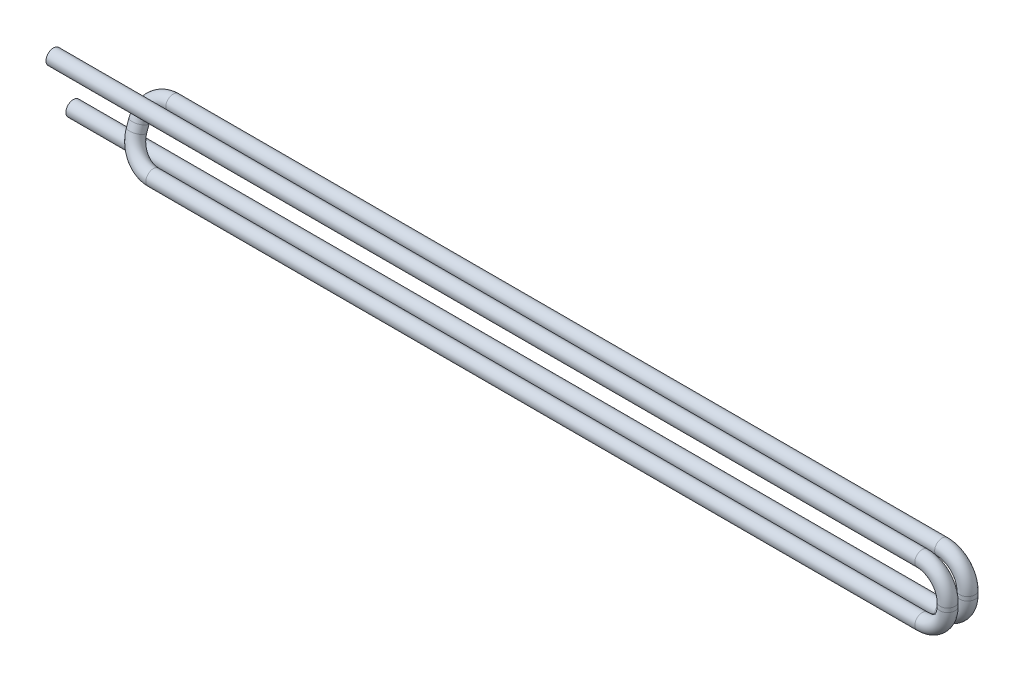
ISO-10303-21;
HEADER;
FILE_DESCRIPTION(('STEP AP214'),'2;1');
FILE_NAME('part.step','',(''),(''),'','','');
FILE_SCHEMA(('AUTOMOTIVE_DESIGN { 1 0 10303 214 1 1 1 1 }'));
ENDSEC;
DATA;
#1=APPLICATION_CONTEXT('core data for automotive mechanical design processes');
#2=APPLICATION_PROTOCOL_DEFINITION('international standard','automotive_design',2000,#1);
#3=PRODUCT_CONTEXT('',#1,'mechanical');
#4=PRODUCT('Part','Part','',(#3));
#5=PRODUCT_RELATED_PRODUCT_CATEGORY('part','',(#4));
#6=PRODUCT_DEFINITION_FORMATION('','',#4);
#7=PRODUCT_DEFINITION_CONTEXT('part definition',#1,'design');
#8=PRODUCT_DEFINITION('design','',#6,#7);
#9=PRODUCT_DEFINITION_SHAPE('','',#8);
#10=(LENGTH_UNIT() NAMED_UNIT(*) SI_UNIT(.MILLI.,.METRE.));
#11=(NAMED_UNIT(*) PLANE_ANGLE_UNIT() SI_UNIT($,.RADIAN.));
#12=(NAMED_UNIT(*) SI_UNIT($,.STERADIAN.) SOLID_ANGLE_UNIT());
#13=UNCERTAINTY_MEASURE_WITH_UNIT(LENGTH_MEASURE(1.E-05),#10,'distance_accuracy_value','');
#14=(GEOMETRIC_REPRESENTATION_CONTEXT(3) GLOBAL_UNCERTAINTY_ASSIGNED_CONTEXT((#13)) GLOBAL_UNIT_ASSIGNED_CONTEXT((#10,
#11,#12)) REPRESENTATION_CONTEXT('',''));
#15=CARTESIAN_POINT('',(0.,0.,0.));
#16=DIRECTION('',(0.,0.,1.));
#17=DIRECTION('',(1.,0.,0.));
#18=AXIS2_PLACEMENT_3D('',#15,#16,#17);
#19=CARTESIAN_POINT('',(-1.02125570784735,2.20000000001825,0.799999999708592));
#20=DIRECTION('',(-1.,0.,0.));
#21=DIRECTION('',(0.,0.,1.));
#22=AXIS2_PLACEMENT_3D('',#19,#20,#21);
#23=CYLINDRICAL_SURFACE('',#22,0.3);
#24=CARTESIAN_POINT('',(-1.02125570784735,2.20000000001825,0.799999999708592));
#25=DIRECTION('',(-1.,0.,0.));
#26=DIRECTION('',(0.,0.642335766239947,-0.766423357817949));
#27=AXIS2_PLACEMENT_3D('',#24,#25,#26);
#28=CIRCLE('',#27,0.3);
#29=CARTESIAN_POINT('',(-1.02125570784735,2.50000000001825,0.799999999708592));
#30=VERTEX_POINT('',#29);
#31=EDGE_CURVE('E38',#30,#30,#28,.T.);
#32=ORIENTED_EDGE('',*,*,#31,.T.);
#33=EDGE_LOOP('',(#32));
#34=FACE_BOUND('',#33,.T.);
#35=CARTESIAN_POINT('',(-36.,2.20000000001825,0.799999999708591));
#36=DIRECTION('',(-1.,0.,0.));
#37=DIRECTION('',(0.,0.642335766239947,-0.766423357817949));
#38=AXIS2_PLACEMENT_3D('',#35,#36,#37);
#39=CIRCLE('',#38,0.3);
#40=CARTESIAN_POINT('',(-36.,2.39270072989023,0.570072992363207));
#41=VERTEX_POINT('',#40);
#42=EDGE_CURVE('E10',#41,#41,#39,.T.);
#43=ORIENTED_EDGE('',*,*,#42,.F.);
#44=EDGE_LOOP('',(#43));
#45=FACE_BOUND('',#44,.T.);
#46=ADVANCED_FACE('F32',(#34,#45),#23,.T.);
#47=CARTESIAN_POINT('',(-1.02125570784735,1.17874429215265,0.799999999708592));
#48=DIRECTION('',(0.,0.,1.));
#49=DIRECTION('',(1.,0.,0.));
#50=AXIS2_PLACEMENT_3D('',#47,#48,#49);
#51=TOROIDAL_SURFACE('',#50,1.0212557078656,0.3);
#52=CARTESIAN_POINT('',(1.82485338164642E-11,1.17874429215265,0.799999999708592));
#53=DIRECTION('',(0.,1.,0.));
#54=DIRECTION('',(0.642335766239947,0.,-0.766423357817949));
#55=AXIS2_PLACEMENT_3D('',#52,#53,#54);
#56=CIRCLE('',#55,0.3);
#57=CARTESIAN_POINT('',(0.300000000018249,1.17874429215265,0.799999999708592));
#58=VERTEX_POINT('',#57);
#59=EDGE_CURVE('E42',#58,#58,#56,.T.);
#60=CARTESIAN_POINT('',(-1.02125570784735,1.17874429215265,0.799999999708592));
#61=DIRECTION('',(0.,0.,1.));
#62=DIRECTION('',(1.,0.,0.));
#63=AXIS2_PLACEMENT_3D('',#60,#61,#62);
#64=CIRCLE('',#63,1.3212557078656);
#65=EDGE_CURVE('',#58,#30,#64,.T.);
#66=ORIENTED_EDGE('',*,*,#59,.T.);
#67=ORIENTED_EDGE('',*,*,#31,.F.);
#68=ORIENTED_EDGE('',*,*,#65,.T.);
#69=ORIENTED_EDGE('',*,*,#65,.F.);
#70=EDGE_LOOP('',(#66,#68,#67,#69));
#71=FACE_BOUND('',#70,.T.);
#72=ADVANCED_FACE('F100',(#71),#51,.T.);
#73=CARTESIAN_POINT('',(1.82486207307168E-11,1.02125570784735,0.799999999708592));
#74=DIRECTION('',(0.,1.,0.));
#75=DIRECTION('',(-1.,0.,0.));
#76=AXIS2_PLACEMENT_3D('',#73,#74,#75);
#77=CYLINDRICAL_SURFACE('',#76,0.3);
#78=CARTESIAN_POINT('',(1.82486207307168E-11,1.02125570784735,0.799999999708592));
#79=DIRECTION('',(0.,1.,0.));
#80=DIRECTION('',(0.642335766239947,0.,-0.766423357817949));
#81=AXIS2_PLACEMENT_3D('',#78,#79,#80);
#82=CIRCLE('',#81,0.3);
#83=CARTESIAN_POINT('',(0.300000000018249,1.02125570784735,0.799999999708592));
#84=VERTEX_POINT('',#83);
#85=EDGE_CURVE('E46',#84,#84,#82,.T.);
#86=ORIENTED_EDGE('',*,*,#85,.T.);
#87=EDGE_LOOP('',(#86));
#88=FACE_BOUND('',#87,.T.);
#89=ORIENTED_EDGE('',*,*,#59,.F.);
#90=EDGE_LOOP('',(#89));
#91=FACE_BOUND('',#90,.T.);
#92=ADVANCED_FACE('F104',(#88,#91),#77,.T.);
#93=CARTESIAN_POINT('',(-1.02125570784735,1.02125570784735,0.799999999708592));
#94=DIRECTION('',(0.,0.,1.));
#95=DIRECTION('',(1.,0.,0.));
#96=AXIS2_PLACEMENT_3D('',#93,#94,#95);
#97=TOROIDAL_SURFACE('',#96,1.0212557078656,0.3);
#98=CARTESIAN_POINT('',(-1.02125570784736,-1.82480908015536E-11,0.799999999708592));
#99=DIRECTION('',(1.,0.,0.));
#100=DIRECTION('',(0.,-0.642335766239947,-0.766423357817949));
#101=AXIS2_PLACEMENT_3D('',#98,#99,#100);
#102=CIRCLE('',#101,0.3);
#103=CARTESIAN_POINT('',(-1.02125570784736,-0.300000000018248,0.799999999708592));
#104=VERTEX_POINT('',#103);
#105=EDGE_CURVE('E51',#104,#104,#102,.T.);
#106=CARTESIAN_POINT('',(-1.02125570784735,1.02125570784735,0.799999999708592));
#107=DIRECTION('',(0.,0.,1.));
#108=DIRECTION('',(1.,0.,0.));
#109=AXIS2_PLACEMENT_3D('',#106,#107,#108);
#110=CIRCLE('',#109,1.3212557078656);
#111=EDGE_CURVE('',#104,#84,#110,.T.);
#112=ORIENTED_EDGE('',*,*,#105,.T.);
#113=ORIENTED_EDGE('',*,*,#85,.F.);
#114=ORIENTED_EDGE('',*,*,#111,.T.);
#115=ORIENTED_EDGE('',*,*,#111,.F.);
#116=EDGE_LOOP('',(#112,#114,#113,#115));
#117=FACE_BOUND('',#116,.T.);
#118=ADVANCED_FACE('F110',(#117),#97,.T.);
#119=CARTESIAN_POINT('',(-31.9787442921527,-1.8249290967276E-11,0.799999999708593));
#120=DIRECTION('',(1.,0.,0.));
#121=DIRECTION('',(0.,1.,0.));
#122=AXIS2_PLACEMENT_3D('',#119,#120,#121);
#123=CYLINDRICAL_SURFACE('',#122,0.3);
#124=CARTESIAN_POINT('',(-31.9787442921527,-1.8249290967276E-11,0.799999999708593));
#125=DIRECTION('',(1.,0.,0.));
#126=DIRECTION('',(0.,-0.642335766239947,-0.766423357817949));
#127=AXIS2_PLACEMENT_3D('',#124,#125,#126);
#128=CIRCLE('',#127,0.3);
#129=CARTESIAN_POINT('',(-31.9787442921527,-0.281938027077051,0.902522918600871));
#130=VERTEX_POINT('',#129);
#131=EDGE_CURVE('E54',#130,#130,#128,.T.);
#132=ORIENTED_EDGE('',*,*,#131,.T.);
#133=EDGE_LOOP('',(#132));
#134=FACE_BOUND('',#133,.T.);
#135=ORIENTED_EDGE('',*,*,#105,.F.);
#136=EDGE_LOOP('',(#135));
#137=FACE_BOUND('',#136,.T.);
#138=ADVANCED_FACE('F117',(#134,#137),#123,.T.);
#139=CARTESIAN_POINT('',(-31.9787442921526,0.959769397967603,0.450992946025579));
#140=DIRECTION('',(0.,0.341743062974255,0.939793423529328));
#141=DIRECTION('',(0.,-0.939793423529328,0.341743062974255));
#142=AXIS2_PLACEMENT_3D('',#139,#140,#141);
#143=TOROIDAL_SURFACE('',#142,1.02125570785706,0.3);
#144=CARTESIAN_POINT('',(-33.0000000000097,0.959769397967603,0.450992946025579));
#145=DIRECTION('',(0.,-0.939793423529327,0.341743062974256));
#146=DIRECTION('',(-0.341743062974255,-0.321167883119971,-0.883211678908975));
#147=AXIS2_PLACEMENT_3D('',#144,#145,#146);
#148=CIRCLE('',#147,0.3);
#149=CARTESIAN_POINT('',(-33.3000000000097,0.959769397967603,0.450992946025579));
#150=VERTEX_POINT('',#149);
#151=EDGE_CURVE('E57',#150,#150,#148,.T.);
#152=CARTESIAN_POINT('',(-31.9787442921526,0.959769397967603,0.450992946025579));
#153=DIRECTION('',(0.,0.341743062974255,0.939793423529328));
#154=DIRECTION('',(0.,-0.939793423529328,0.341743062974255));
#155=AXIS2_PLACEMENT_3D('',#152,#153,#154);
#156=CIRCLE('',#155,1.32125570785706);
#157=EDGE_CURVE('',#150,#130,#156,.T.);
#158=ORIENTED_EDGE('',*,*,#151,.T.);
#159=ORIENTED_EDGE('',*,*,#131,.F.);
#160=ORIENTED_EDGE('',*,*,#157,.T.);
#161=ORIENTED_EDGE('',*,*,#157,.F.);
#162=EDGE_LOOP('',(#158,#160,#159,#161));
#163=FACE_BOUND('',#162,.T.);
#164=ADVANCED_FACE('F121',(#163),#143,.T.);
#165=CARTESIAN_POINT('',(-33.0000000000097,1.24023060201414,0.349007053683015));
#166=DIRECTION('',(0.,-0.939793423529328,0.341743062974255));
#167=DIRECTION('',(0.,-0.341743062974255,-0.939793423529328));
#168=AXIS2_PLACEMENT_3D('',#165,#166,#167);
#169=CYLINDRICAL_SURFACE('',#168,0.3);
#170=CARTESIAN_POINT('',(-33.0000000000097,1.24023060201414,0.349007053683015));
#171=DIRECTION('',(0.,-0.939793423529327,0.341743062974256));
#172=DIRECTION('',(-0.341743062974255,-0.321167883119971,-0.883211678908975));
#173=AXIS2_PLACEMENT_3D('',#170,#171,#172);
#174=CIRCLE('',#173,0.3);
#175=CARTESIAN_POINT('',(-33.3000000000097,1.24023060201414,0.349007053683015));
#176=VERTEX_POINT('',#175);
#177=EDGE_CURVE('E60',#176,#176,#174,.T.);
#178=ORIENTED_EDGE('',*,*,#177,.T.);
#179=EDGE_LOOP('',(#178));
#180=FACE_BOUND('',#179,.T.);
#181=ORIENTED_EDGE('',*,*,#151,.F.);
#182=EDGE_LOOP('',(#181));
#183=FACE_BOUND('',#182,.T.);
#184=ADVANCED_FACE('F125',(#180,#183),#169,.T.);
#185=CARTESIAN_POINT('',(-31.9787442921526,1.24023060201414,0.349007053683014));
#186=DIRECTION('',(0.,0.341743062974255,0.939793423529328));
#187=DIRECTION('',(0.,-0.939793423529328,0.341743062974255));
#188=AXIS2_PLACEMENT_3D('',#185,#186,#187);
#189=TOROIDAL_SURFACE('',#188,1.02125570785707,0.3);
#190=CARTESIAN_POINT('',(-31.9787442921527,2.2,0.));
#191=DIRECTION('',(-1.,0.,0.));
#192=DIRECTION('',(0.,0.,-1.));
#193=AXIS2_PLACEMENT_3D('',#190,#191,#192);
#194=CIRCLE('',#193,0.3);
#195=CARTESIAN_POINT('',(-31.9787442921527,2.4819380270588,-0.102522918892277));
#196=VERTEX_POINT('',#195);
#197=EDGE_CURVE('E63',#196,#196,#194,.T.);
#198=CARTESIAN_POINT('',(-31.9787442921526,1.24023060201414,0.349007053683014));
#199=DIRECTION('',(0.,0.341743062974255,0.939793423529328));
#200=DIRECTION('',(0.,-0.939793423529328,0.341743062974255));
#201=AXIS2_PLACEMENT_3D('',#198,#199,#200);
#202=CIRCLE('',#201,1.32125570785707);
#203=EDGE_CURVE('',#196,#176,#202,.T.);
#204=ORIENTED_EDGE('',*,*,#197,.T.);
#205=ORIENTED_EDGE('',*,*,#177,.F.);
#206=ORIENTED_EDGE('',*,*,#203,.T.);
#207=ORIENTED_EDGE('',*,*,#203,.F.);
#208=EDGE_LOOP('',(#204,#206,#205,#207));
#209=FACE_BOUND('',#208,.T.);
#210=ADVANCED_FACE('F129',(#209),#189,.T.);
#211=CARTESIAN_POINT('',(-1.02125570784736,2.2,0.));
#212=DIRECTION('',(-1.,0.,0.));
#213=DIRECTION('',(0.,0.,1.));
#214=AXIS2_PLACEMENT_3D('',#211,#212,#213);
#215=CYLINDRICAL_SURFACE('',#214,0.3);
#216=CARTESIAN_POINT('',(-1.02125570784736,2.2,0.));
#217=DIRECTION('',(-1.,0.,0.));
#218=DIRECTION('',(0.,0.,-1.));
#219=AXIS2_PLACEMENT_3D('',#216,#217,#218);
#220=CIRCLE('',#219,0.3);
#221=CARTESIAN_POINT('',(-1.02125570784736,2.5,0.));
#222=VERTEX_POINT('',#221);
#223=EDGE_CURVE('E66',#222,#222,#220,.T.);
#224=ORIENTED_EDGE('',*,*,#223,.T.);
#225=EDGE_LOOP('',(#224));
#226=FACE_BOUND('',#225,.T.);
#227=ORIENTED_EDGE('',*,*,#197,.F.);
#228=EDGE_LOOP('',(#227));
#229=FACE_BOUND('',#228,.T.);
#230=ADVANCED_FACE('F133',(#226,#229),#215,.T.);
#231=CARTESIAN_POINT('',(-1.02125570784736,1.17874429215265,0.));
#232=DIRECTION('',(0.,0.,1.));
#233=DIRECTION('',(1.,0.,0.));
#234=AXIS2_PLACEMENT_3D('',#231,#232,#233);
#235=TOROIDAL_SURFACE('',#234,1.02125570784735,0.3);
#236=CARTESIAN_POINT('',(0.,1.17874429215264,0.));
#237=DIRECTION('',(0.,1.,0.));
#238=DIRECTION('',(0.,0.,-1.));
#239=AXIS2_PLACEMENT_3D('',#236,#237,#238);
#240=CIRCLE('',#239,0.3);
#241=CARTESIAN_POINT('',(0.299999999999998,1.17874429215264,0.));
#242=VERTEX_POINT('',#241);
#243=EDGE_CURVE('E69',#242,#242,#240,.T.);
#244=CARTESIAN_POINT('',(-1.02125570784736,1.17874429215265,0.));
#245=DIRECTION('',(0.,0.,1.));
#246=DIRECTION('',(1.,0.,0.));
#247=AXIS2_PLACEMENT_3D('',#244,#245,#246);
#248=CIRCLE('',#247,1.32125570784735);
#249=EDGE_CURVE('',#242,#222,#248,.T.);
#250=ORIENTED_EDGE('',*,*,#243,.T.);
#251=ORIENTED_EDGE('',*,*,#223,.F.);
#252=ORIENTED_EDGE('',*,*,#249,.T.);
#253=ORIENTED_EDGE('',*,*,#249,.F.);
#254=EDGE_LOOP('',(#250,#252,#251,#253));
#255=FACE_BOUND('',#254,.T.);
#256=ADVANCED_FACE('F137',(#255),#235,.T.);
#257=CARTESIAN_POINT('',(0.,1.02125570784735,0.));
#258=DIRECTION('',(0.,1.,0.));
#259=DIRECTION('',(-1.,0.,0.));
#260=AXIS2_PLACEMENT_3D('',#257,#258,#259);
#261=CYLINDRICAL_SURFACE('',#260,0.3);
#262=CARTESIAN_POINT('',(0.,1.02125570784735,0.));
#263=DIRECTION('',(0.,1.,0.));
#264=DIRECTION('',(0.,0.,-1.));
#265=AXIS2_PLACEMENT_3D('',#262,#263,#264);
#266=CIRCLE('',#265,0.3);
#267=CARTESIAN_POINT('',(0.299999999999997,1.02125570784735,0.));
#268=VERTEX_POINT('',#267);
#269=EDGE_CURVE('E72',#268,#268,#266,.T.);
#270=ORIENTED_EDGE('',*,*,#269,.T.);
#271=EDGE_LOOP('',(#270));
#272=FACE_BOUND('',#271,.T.);
#273=ORIENTED_EDGE('',*,*,#243,.F.);
#274=EDGE_LOOP('',(#273));
#275=FACE_BOUND('',#274,.T.);
#276=ADVANCED_FACE('F141',(#272,#275),#261,.T.);
#277=CARTESIAN_POINT('',(-1.02125570784736,1.02125570784735,0.));
#278=DIRECTION('',(0.,0.,1.));
#279=DIRECTION('',(1.,0.,0.));
#280=AXIS2_PLACEMENT_3D('',#277,#278,#279);
#281=TOROIDAL_SURFACE('',#280,1.02125570784735,0.3);
#282=CARTESIAN_POINT('',(-1.02125570784735,0.,0.));
#283=DIRECTION('',(1.,0.,0.));
#284=DIRECTION('',(0.,0.,-1.));
#285=AXIS2_PLACEMENT_3D('',#282,#283,#284);
#286=CIRCLE('',#285,0.3);
#287=CARTESIAN_POINT('',(-1.02125570784735,-0.3,0.));
#288=VERTEX_POINT('',#287);
#289=EDGE_CURVE('E75',#288,#288,#286,.T.);
#290=CARTESIAN_POINT('',(-1.02125570784736,1.02125570784735,0.));
#291=DIRECTION('',(0.,0.,1.));
#292=DIRECTION('',(1.,0.,0.));
#293=AXIS2_PLACEMENT_3D('',#290,#291,#292);
#294=CIRCLE('',#293,1.32125570784735);
#295=EDGE_CURVE('',#288,#268,#294,.T.);
#296=ORIENTED_EDGE('',*,*,#289,.T.);
#297=ORIENTED_EDGE('',*,*,#269,.F.);
#298=ORIENTED_EDGE('',*,*,#295,.T.);
#299=ORIENTED_EDGE('',*,*,#295,.F.);
#300=EDGE_LOOP('',(#296,#298,#297,#299));
#301=FACE_BOUND('',#300,.T.);
#302=ADVANCED_FACE('F82',(#301),#281,.T.);
#303=CARTESIAN_POINT('',(-1.02125570784735,0.,0.));
#304=DIRECTION('',(-1.,0.,0.));
#305=DIRECTION('',(0.,0.,1.));
#306=AXIS2_PLACEMENT_3D('',#303,#304,#305);
#307=CYLINDRICAL_SURFACE('',#306,0.3);
#308=ORIENTED_EDGE('',*,*,#289,.F.);
#309=EDGE_LOOP('',(#308));
#310=FACE_BOUND('',#309,.T.);
#311=CARTESIAN_POINT('',(-36.,0.,0.));
#312=DIRECTION('',(1.,0.,0.));
#313=DIRECTION('',(0.,0.,-1.));
#314=AXIS2_PLACEMENT_3D('',#311,#312,#313);
#315=CIRCLE('',#314,0.3);
#316=CARTESIAN_POINT('',(-36.,0.,-0.3));
#317=VERTEX_POINT('',#316);
#318=EDGE_CURVE('E76',#317,#317,#315,.T.);
#319=ORIENTED_EDGE('',*,*,#318,.T.);
#320=EDGE_LOOP('',(#319));
#321=FACE_BOUND('',#320,.T.);
#322=ADVANCED_FACE('F85',(#310,#321),#307,.T.);
#323=CARTESIAN_POINT('',(-36.,2.20000000001825,0.799999999708591));
#324=DIRECTION('',(-1.,0.,0.));
#325=DIRECTION('',(0.,0.642335766239947,-0.766423357817949));
#326=AXIS2_PLACEMENT_3D('',#323,#324,#325);
#327=PLANE('',#326);
#328=ORIENTED_EDGE('',*,*,#42,.T.);
#329=EDGE_LOOP('',(#328));
#330=FACE_BOUND('',#329,.T.);
#331=ADVANCED_FACE('F88',(#330),#327,.T.);
#332=CARTESIAN_POINT('',(-36.,0.,0.));
#333=DIRECTION('',(1.,0.,0.));
#334=DIRECTION('',(0.,0.,-1.));
#335=AXIS2_PLACEMENT_3D('',#332,#333,#334);
#336=PLANE('',#335);
#337=ORIENTED_EDGE('',*,*,#318,.F.);
#338=EDGE_LOOP('',(#337));
#339=FACE_BOUND('',#338,.T.);
#340=ADVANCED_FACE('F92',(#339),#336,.F.);
#341=CLOSED_SHELL('',(#46,#72,#92,#118,#138,#164,#184,#210,#230,#256,#276,#302,#322,#331,#340));
#342=MANIFOLD_SOLID_BREP('B2',#341);
#343=ADVANCED_BREP_SHAPE_REPRESENTATION('',(#18,#342),#14);
#344=SHAPE_DEFINITION_REPRESENTATION(#9,#343);
ENDSEC;
END-ISO-10303-21;
